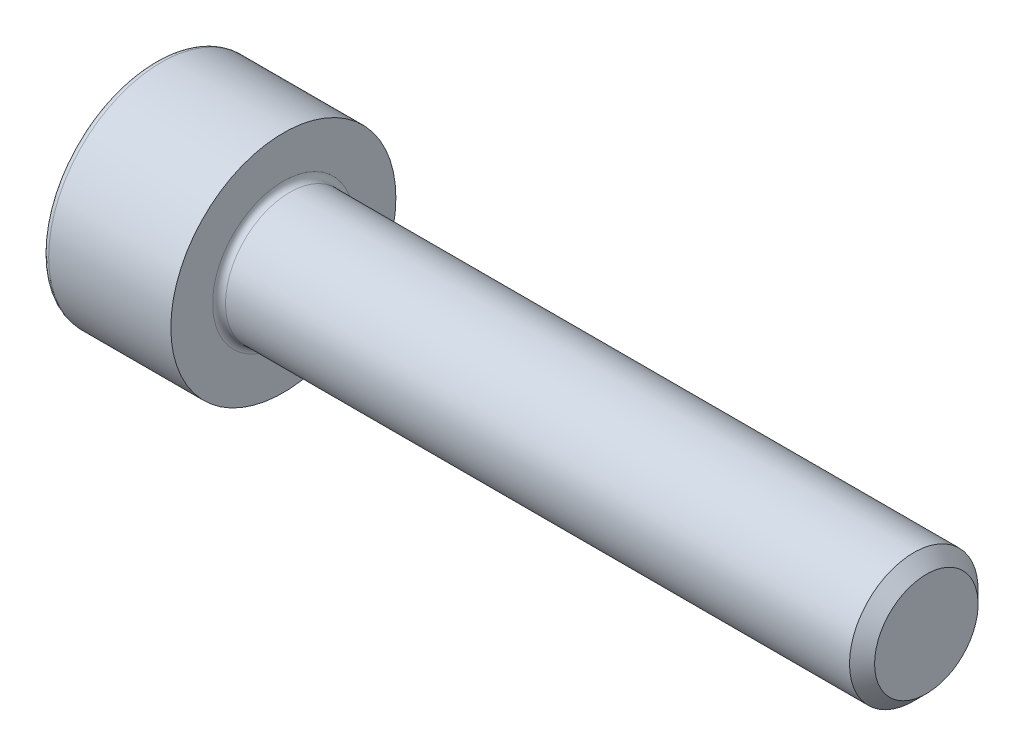
ISO-10303-21;
HEADER;
FILE_DESCRIPTION(('STEP AP214'),'2;1');
FILE_NAME('part.step','',(''),(''),'','','');
FILE_SCHEMA(('AUTOMOTIVE_DESIGN { 1 0 10303 214 1 1 1 1 }'));
ENDSEC;
DATA;
#1=APPLICATION_CONTEXT('core data for automotive mechanical design processes');
#2=APPLICATION_PROTOCOL_DEFINITION('international standard','automotive_design',2000,#1);
#3=PRODUCT_CONTEXT('',#1,'mechanical');
#4=PRODUCT('Part','Part','',(#3));
#5=PRODUCT_RELATED_PRODUCT_CATEGORY('part','',(#4));
#6=PRODUCT_DEFINITION_FORMATION('','',#4);
#7=PRODUCT_DEFINITION_CONTEXT('part definition',#1,'design');
#8=PRODUCT_DEFINITION('design','',#6,#7);
#9=PRODUCT_DEFINITION_SHAPE('','',#8);
#10=(LENGTH_UNIT() NAMED_UNIT(*) SI_UNIT(.MILLI.,.METRE.));
#11=(NAMED_UNIT(*) PLANE_ANGLE_UNIT() SI_UNIT($,.RADIAN.));
#12=(NAMED_UNIT(*) SI_UNIT($,.STERADIAN.) SOLID_ANGLE_UNIT());
#13=UNCERTAINTY_MEASURE_WITH_UNIT(LENGTH_MEASURE(1.E-05),#10,'distance_accuracy_value','');
#14=(GEOMETRIC_REPRESENTATION_CONTEXT(3) GLOBAL_UNCERTAINTY_ASSIGNED_CONTEXT((#13)) GLOBAL_UNIT_ASSIGNED_CONTEXT((#10,
#11,#12)) REPRESENTATION_CONTEXT('',''));
#15=CARTESIAN_POINT('',(0.,0.,0.));
#16=DIRECTION('',(0.,0.,1.));
#17=DIRECTION('',(1.,0.,0.));
#18=AXIS2_PLACEMENT_3D('',#15,#16,#17);
#19=CARTESIAN_POINT('',(0.,0.,0.));
#20=DIRECTION('',(-1.,0.,0.));
#21=DIRECTION('',(0.,0.,1.));
#22=AXIS2_PLACEMENT_3D('',#19,#20,#21);
#23=PLANE('',#22);
#24=DIRECTION('',(0.,-0.5,0.866025403784439));
#25=VECTOR('',#24,1.);
#26=CARTESIAN_POINT('',(0.,1.77304267668134,0.));
#27=LINE('',#26,#25);
#28=CARTESIAN_POINT('',(0.,1.77304267668134,0.));
#29=VERTEX_POINT('',#28);
#30=CARTESIAN_POINT('',(0.,0.886521338340667,1.5355));
#31=VERTEX_POINT('',#30);
#32=EDGE_CURVE('E261',#29,#31,#27,.T.);
#33=ORIENTED_EDGE('',*,*,#32,.T.);
#34=DIRECTION('',(0.,1.,0.));
#35=VECTOR('',#34,1.);
#36=CARTESIAN_POINT('',(0.,-0.886521338340676,1.5355));
#37=LINE('',#36,#35);
#38=CARTESIAN_POINT('',(0.,-0.886521338340676,1.5355));
#39=VERTEX_POINT('',#38);
#40=EDGE_CURVE('E133',#39,#31,#37,.T.);
#41=ORIENTED_EDGE('',*,*,#40,.F.);
#42=DIRECTION('',(0.,-0.500000000000001,-0.866025403784438));
#43=VECTOR('',#42,1.);
#44=CARTESIAN_POINT('',(0.,-0.886521338340676,1.5355));
#45=LINE('',#44,#43);
#46=CARTESIAN_POINT('',(0.,-1.77304267668135,0.));
#47=VERTEX_POINT('',#46);
#48=EDGE_CURVE('E264',#39,#47,#45,.T.);
#49=ORIENTED_EDGE('',*,*,#48,.T.);
#50=DIRECTION('',(0.,0.5,-0.866025403784439));
#51=VECTOR('',#50,1.);
#52=CARTESIAN_POINT('',(0.,-1.77304267668135,0.));
#53=LINE('',#52,#51);
#54=CARTESIAN_POINT('',(0.,-0.886521338340678,-1.5355));
#55=VERTEX_POINT('',#54);
#56=EDGE_CURVE('E267',#47,#55,#53,.T.);
#57=ORIENTED_EDGE('',*,*,#56,.T.);
#58=DIRECTION('',(0.,-1.,0.));
#59=VECTOR('',#58,1.);
#60=CARTESIAN_POINT('',(0.,0.886521338340663,-1.5355));
#61=LINE('',#60,#59);
#62=CARTESIAN_POINT('',(0.,0.886521338340663,-1.5355));
#63=VERTEX_POINT('',#62);
#64=EDGE_CURVE('E270',#63,#55,#61,.T.);
#65=ORIENTED_EDGE('',*,*,#64,.F.);
#66=DIRECTION('',(0.,-0.500000000000001,-0.866025403784438));
#67=VECTOR('',#66,1.);
#68=CARTESIAN_POINT('',(0.,1.77304267668134,0.));
#69=LINE('',#68,#67);
#70=EDGE_CURVE('E128',#29,#63,#69,.T.);
#71=ORIENTED_EDGE('',*,*,#70,.F.);
#72=EDGE_LOOP('',(#33,#41,#49,#57,#65,#71));
#73=FACE_BOUND('',#72,.T.);
#74=CARTESIAN_POINT('',(0.,0.,0.));
#75=DIRECTION('',(-1.,0.,0.));
#76=DIRECTION('',(0.,0.,1.));
#77=AXIS2_PLACEMENT_3D('',#74,#75,#76);
#78=CIRCLE('',#77,3.3);
#79=CARTESIAN_POINT('',(0.,0.,3.3));
#80=VERTEX_POINT('',#79);
#81=EDGE_CURVE('E45',#80,#80,#78,.T.);
#82=ORIENTED_EDGE('',*,*,#81,.T.);
#83=EDGE_LOOP('',(#82));
#84=FACE_BOUND('',#83,.T.);
#85=ADVANCED_FACE('F37',(#73,#84),#23,.T.);
#86=CARTESIAN_POINT('',(-31.75,0.,0.));
#87=DIRECTION('',(-1.,0.,0.));
#88=DIRECTION('',(0.,0.,1.));
#89=AXIS2_PLACEMENT_3D('',#86,#87,#88);
#90=CYLINDRICAL_SURFACE('',#89,3.5);
#91=CARTESIAN_POINT('',(0.199999999999999,0.,0.));
#92=DIRECTION('',(-1.,0.,0.));
#93=DIRECTION('',(0.,0.,1.));
#94=AXIS2_PLACEMENT_3D('',#91,#92,#93);
#95=CIRCLE('',#94,3.5);
#96=CARTESIAN_POINT('',(0.199999999999999,0.,3.5));
#97=VERTEX_POINT('',#96);
#98=EDGE_CURVE('E11',#97,#97,#95,.F.);
#99=ORIENTED_EDGE('',*,*,#98,.T.);
#100=EDGE_LOOP('',(#99));
#101=FACE_BOUND('',#100,.T.);
#102=CARTESIAN_POINT('',(4.,0.,0.));
#103=DIRECTION('',(-1.,0.,0.));
#104=DIRECTION('',(0.,0.,1.));
#105=AXIS2_PLACEMENT_3D('',#102,#103,#104);
#106=CIRCLE('',#105,3.5);
#107=CARTESIAN_POINT('',(4.,0.,3.5));
#108=VERTEX_POINT('',#107);
#109=EDGE_CURVE('E151',#108,#108,#106,.T.);
#110=ORIENTED_EDGE('',*,*,#109,.T.);
#111=EDGE_LOOP('',(#110));
#112=FACE_BOUND('',#111,.T.);
#113=ADVANCED_FACE('F175',(#101,#112),#90,.T.);
#114=CARTESIAN_POINT('',(4.,3.5,0.));
#115=DIRECTION('',(1.,0.,0.));
#116=DIRECTION('',(0.,0.,-1.));
#117=AXIS2_PLACEMENT_3D('',#114,#115,#116);
#118=PLANE('',#117);
#119=CARTESIAN_POINT('',(4.,0.,0.));
#120=DIRECTION('',(1.,0.,0.));
#121=DIRECTION('',(0.,0.,-1.));
#122=AXIS2_PLACEMENT_3D('',#119,#120,#121);
#123=CIRCLE('',#122,2.2);
#124=CARTESIAN_POINT('',(4.,0.,-2.2));
#125=VERTEX_POINT('',#124);
#126=EDGE_CURVE('E154',#125,#125,#123,.F.);
#127=ORIENTED_EDGE('',*,*,#126,.T.);
#128=EDGE_LOOP('',(#127));
#129=FACE_BOUND('',#128,.T.);
#130=ORIENTED_EDGE('',*,*,#109,.F.);
#131=EDGE_LOOP('',(#130));
#132=FACE_BOUND('',#131,.T.);
#133=ADVANCED_FACE('F181',(#129,#132),#118,.T.);
#134=CARTESIAN_POINT('',(-31.75,0.,0.));
#135=DIRECTION('',(-1.,0.,0.));
#136=DIRECTION('',(0.,0.,1.));
#137=AXIS2_PLACEMENT_3D('',#134,#135,#136);
#138=CYLINDRICAL_SURFACE('',#137,2.);
#139=CARTESIAN_POINT('',(4.2,0.,0.));
#140=DIRECTION('',(1.,0.,0.));
#141=DIRECTION('',(0.,0.,-1.));
#142=AXIS2_PLACEMENT_3D('',#139,#140,#141);
#143=CIRCLE('',#142,2.);
#144=CARTESIAN_POINT('',(4.2,0.,-2.));
#145=VERTEX_POINT('',#144);
#146=EDGE_CURVE('E157',#145,#145,#143,.T.);
#147=ORIENTED_EDGE('',*,*,#146,.T.);
#148=EDGE_LOOP('',(#147));
#149=FACE_BOUND('',#148,.T.);
#150=CARTESIAN_POINT('',(23.61,0.,0.));
#151=DIRECTION('',(-1.,0.,0.));
#152=DIRECTION('',(0.,0.,1.));
#153=AXIS2_PLACEMENT_3D('',#150,#151,#152);
#154=CIRCLE('',#153,2.);
#155=CARTESIAN_POINT('',(23.61,0.,2.));
#156=VERTEX_POINT('',#155);
#157=EDGE_CURVE('E148',#156,#156,#154,.T.);
#158=ORIENTED_EDGE('',*,*,#157,.T.);
#159=EDGE_LOOP('',(#158));
#160=FACE_BOUND('',#159,.T.);
#161=ADVANCED_FACE('F187',(#149,#160),#138,.T.);
#162=CARTESIAN_POINT('',(24.,0.,0.));
#163=DIRECTION('',(-1.,0.,0.));
#164=DIRECTION('',(0.,0.,1.));
#165=AXIS2_PLACEMENT_3D('',#162,#163,#164);
#166=CONICAL_SURFACE('',#165,1.61,0.785398163397456);
#167=ORIENTED_EDGE('',*,*,#157,.F.);
#168=EDGE_LOOP('',(#167));
#169=FACE_BOUND('',#168,.T.);
#170=CARTESIAN_POINT('',(24.,0.,0.));
#171=DIRECTION('',(-1.,0.,0.));
#172=DIRECTION('',(0.,0.,1.));
#173=AXIS2_PLACEMENT_3D('',#170,#171,#172);
#174=CIRCLE('',#173,1.61);
#175=CARTESIAN_POINT('',(24.,0.,1.61));
#176=VERTEX_POINT('',#175);
#177=EDGE_CURVE('E144',#176,#176,#174,.T.);
#178=ORIENTED_EDGE('',*,*,#177,.T.);
#179=EDGE_LOOP('',(#178));
#180=FACE_BOUND('',#179,.T.);
#181=ADVANCED_FACE('F191',(#169,#180),#166,.T.);
#182=CARTESIAN_POINT('',(24.,1.61,0.));
#183=DIRECTION('',(1.,0.,0.));
#184=DIRECTION('',(0.,0.,-1.));
#185=AXIS2_PLACEMENT_3D('',#182,#183,#184);
#186=PLANE('',#185);
#187=ORIENTED_EDGE('',*,*,#177,.F.);
#188=EDGE_LOOP('',(#187));
#189=FACE_BOUND('',#188,.T.);
#190=ADVANCED_FACE('F171',(#189),#186,.T.);
#191=CARTESIAN_POINT('',(4.2,0.,0.));
#192=DIRECTION('',(1.,0.,0.));
#193=DIRECTION('',(0.,0.,-1.));
#194=AXIS2_PLACEMENT_3D('',#191,#192,#193);
#195=TOROIDAL_SURFACE('',#194,2.2,0.2);
#196=ORIENTED_EDGE('',*,*,#146,.F.);
#197=EDGE_LOOP('',(#196));
#198=FACE_BOUND('',#197,.T.);
#199=ORIENTED_EDGE('',*,*,#126,.F.);
#200=EDGE_LOOP('',(#199));
#201=FACE_BOUND('',#200,.T.);
#202=ADVANCED_FACE('F164',(#198,#201),#195,.F.);
#203=CARTESIAN_POINT('',(0.199999999999999,0.,0.));
#204=DIRECTION('',(-1.,0.,0.));
#205=DIRECTION('',(0.,0.,1.));
#206=AXIS2_PLACEMENT_3D('',#203,#204,#205);
#207=TOROIDAL_SURFACE('',#206,3.3,0.2);
#208=ORIENTED_EDGE('',*,*,#98,.F.);
#209=EDGE_LOOP('',(#208));
#210=FACE_BOUND('',#209,.T.);
#211=ORIENTED_EDGE('',*,*,#81,.F.);
#212=EDGE_LOOP('',(#211));
#213=FACE_BOUND('',#212,.T.);
#214=ADVANCED_FACE('F39',(#210,#213),#207,.T.);
#215=CARTESIAN_POINT('',(2.,1.77304267668134,0.));
#216=DIRECTION('',(0.,-0.866025403784439,-0.499999999999999));
#217=DIRECTION('',(0.,0.5,-0.866025403784439));
#218=AXIS2_PLACEMENT_3D('',#215,#216,#217);
#219=PLANE('',#218);
#220=ORIENTED_EDGE('',*,*,#32,.F.);
#221=DIRECTION('',(-1.,0.,0.));
#222=VECTOR('',#221,1.);
#223=CARTESIAN_POINT('',(2.,1.77304267668134,0.));
#224=LINE('',#223,#222);
#225=CARTESIAN_POINT('',(2.,1.77304267668134,0.));
#226=VERTEX_POINT('',#225);
#227=EDGE_CURVE('E251',#226,#29,#224,.T.);
#228=ORIENTED_EDGE('',*,*,#227,.F.);
#229=DIRECTION('',(0.,-0.5,0.866025403784439));
#230=VECTOR('',#229,1.);
#231=CARTESIAN_POINT('',(2.,1.77304267668134,0.));
#232=LINE('',#231,#230);
#233=CARTESIAN_POINT('',(2.,1.329782007511,0.767749999999998));
#234=VERTEX_POINT('',#233);
#235=EDGE_CURVE('E120',#226,#234,#232,.T.);
#236=ORIENTED_EDGE('',*,*,#235,.T.);
#237=CARTESIAN_POINT('',(2.,0.886521338340667,1.5355));
#238=VERTEX_POINT('',#237);
#239=EDGE_CURVE('E111',#234,#238,#232,.T.);
#240=ORIENTED_EDGE('',*,*,#239,.T.);
#241=DIRECTION('',(-1.,0.,0.));
#242=VECTOR('',#241,1.);
#243=CARTESIAN_POINT('',(2.,0.886521338340667,1.5355));
#244=LINE('',#243,#242);
#245=EDGE_CURVE('E125',#238,#31,#244,.T.);
#246=ORIENTED_EDGE('',*,*,#245,.T.);
#247=EDGE_LOOP('',(#220,#228,#236,#240,#246));
#248=FACE_BOUND('',#247,.T.);
#249=ADVANCED_FACE('F124',(#248),#219,.T.);
#250=CARTESIAN_POINT('',(2.,-0.886521338340676,1.5355));
#251=DIRECTION('',(0.,0.,1.));
#252=DIRECTION('',(0.,-1.,0.));
#253=AXIS2_PLACEMENT_3D('',#250,#251,#252);
#254=PLANE('',#253);
#255=ORIENTED_EDGE('',*,*,#40,.T.);
#256=ORIENTED_EDGE('',*,*,#245,.F.);
#257=DIRECTION('',(0.,1.,0.));
#258=VECTOR('',#257,1.);
#259=CARTESIAN_POINT('',(2.,-0.886521338340676,1.5355));
#260=LINE('',#259,#258);
#261=CARTESIAN_POINT('',(2.,0.,1.5355));
#262=VERTEX_POINT('',#261);
#263=EDGE_CURVE('E108',#262,#238,#260,.T.);
#264=ORIENTED_EDGE('',*,*,#263,.F.);
#265=CARTESIAN_POINT('',(2.,-0.886521338340676,1.5355));
#266=VERTEX_POINT('',#265);
#267=EDGE_CURVE('E119',#266,#262,#260,.T.);
#268=ORIENTED_EDGE('',*,*,#267,.F.);
#269=DIRECTION('',(-1.,0.,0.));
#270=VECTOR('',#269,1.);
#271=CARTESIAN_POINT('',(2.,-0.886521338340676,1.5355));
#272=LINE('',#271,#270);
#273=EDGE_CURVE('E135',#266,#39,#272,.T.);
#274=ORIENTED_EDGE('',*,*,#273,.T.);
#275=EDGE_LOOP('',(#255,#256,#264,#268,#274));
#276=FACE_BOUND('',#275,.T.);
#277=ADVANCED_FACE('F130',(#276),#254,.F.);
#278=CARTESIAN_POINT('',(2.,-0.886521338340676,1.5355));
#279=DIRECTION('',(0.,0.866025403784438,-0.500000000000001));
#280=DIRECTION('',(0.,0.500000000000001,0.866025403784438));
#281=AXIS2_PLACEMENT_3D('',#278,#279,#280);
#282=PLANE('',#281);
#283=ORIENTED_EDGE('',*,*,#48,.F.);
#284=ORIENTED_EDGE('',*,*,#273,.F.);
#285=DIRECTION('',(0.,-0.500000000000001,-0.866025403784438));
#286=VECTOR('',#285,1.);
#287=CARTESIAN_POINT('',(2.,-0.886521338340676,1.5355));
#288=LINE('',#287,#286);
#289=CARTESIAN_POINT('',(2.,-1.32978200751101,0.767750000000005));
#290=VERTEX_POINT('',#289);
#291=EDGE_CURVE('E290',#266,#290,#288,.T.);
#292=ORIENTED_EDGE('',*,*,#291,.T.);
#293=CARTESIAN_POINT('',(2.,-1.77304267668135,0.));
#294=VERTEX_POINT('',#293);
#295=EDGE_CURVE('E279',#290,#294,#288,.T.);
#296=ORIENTED_EDGE('',*,*,#295,.T.);
#297=DIRECTION('',(-1.,0.,0.));
#298=VECTOR('',#297,1.);
#299=CARTESIAN_POINT('',(2.,-1.77304267668135,0.));
#300=LINE('',#299,#298);
#301=EDGE_CURVE('E140',#294,#47,#300,.T.);
#302=ORIENTED_EDGE('',*,*,#301,.T.);
#303=EDGE_LOOP('',(#283,#284,#292,#296,#302));
#304=FACE_BOUND('',#303,.T.);
#305=ADVANCED_FACE('F205',(#304),#282,.T.);
#306=CARTESIAN_POINT('',(2.,-1.77304267668135,0.));
#307=DIRECTION('',(0.,0.866025403784439,0.5));
#308=DIRECTION('',(0.,-0.5,0.866025403784439));
#309=AXIS2_PLACEMENT_3D('',#306,#307,#308);
#310=PLANE('',#309);
#311=ORIENTED_EDGE('',*,*,#56,.F.);
#312=ORIENTED_EDGE('',*,*,#301,.F.);
#313=DIRECTION('',(0.,0.5,-0.866025403784439));
#314=VECTOR('',#313,1.);
#315=CARTESIAN_POINT('',(2.,-1.77304267668135,0.));
#316=LINE('',#315,#314);
#317=CARTESIAN_POINT('',(2.,-1.32978200751101,-0.767750000000002));
#318=VERTEX_POINT('',#317);
#319=EDGE_CURVE('E257',#294,#318,#316,.T.);
#320=ORIENTED_EDGE('',*,*,#319,.T.);
#321=CARTESIAN_POINT('',(2.,-0.886521338340678,-1.5355));
#322=VERTEX_POINT('',#321);
#323=EDGE_CURVE('E289',#318,#322,#316,.T.);
#324=ORIENTED_EDGE('',*,*,#323,.T.);
#325=DIRECTION('',(-1.,0.,0.));
#326=VECTOR('',#325,1.);
#327=CARTESIAN_POINT('',(2.,-0.886521338340678,-1.5355));
#328=LINE('',#327,#326);
#329=EDGE_CURVE('E250',#322,#55,#328,.T.);
#330=ORIENTED_EDGE('',*,*,#329,.T.);
#331=EDGE_LOOP('',(#311,#312,#320,#324,#330));
#332=FACE_BOUND('',#331,.T.);
#333=ADVANCED_FACE('F208',(#332),#310,.T.);
#334=CARTESIAN_POINT('',(2.,0.886521338340663,-1.5355));
#335=DIRECTION('',(0.,0.,-1.));
#336=DIRECTION('',(0.,1.,0.));
#337=AXIS2_PLACEMENT_3D('',#334,#335,#336);
#338=PLANE('',#337);
#339=ORIENTED_EDGE('',*,*,#64,.T.);
#340=ORIENTED_EDGE('',*,*,#329,.F.);
#341=DIRECTION('',(0.,-1.,0.));
#342=VECTOR('',#341,1.);
#343=CARTESIAN_POINT('',(2.,0.886521338340663,-1.5355));
#344=LINE('',#343,#342);
#345=CARTESIAN_POINT('',(2.,0.,-1.5355));
#346=VERTEX_POINT('',#345);
#347=EDGE_CURVE('E254',#346,#322,#344,.T.);
#348=ORIENTED_EDGE('',*,*,#347,.F.);
#349=CARTESIAN_POINT('',(2.,0.886521338340663,-1.5355));
#350=VERTEX_POINT('',#349);
#351=EDGE_CURVE('E52',#350,#346,#344,.T.);
#352=ORIENTED_EDGE('',*,*,#351,.F.);
#353=DIRECTION('',(-1.,0.,0.));
#354=VECTOR('',#353,1.);
#355=CARTESIAN_POINT('',(2.,0.886521338340663,-1.5355));
#356=LINE('',#355,#354);
#357=EDGE_CURVE('E247',#350,#63,#356,.T.);
#358=ORIENTED_EDGE('',*,*,#357,.T.);
#359=EDGE_LOOP('',(#339,#340,#348,#352,#358));
#360=FACE_BOUND('',#359,.T.);
#361=ADVANCED_FACE('F212',(#360),#338,.F.);
#362=CARTESIAN_POINT('',(2.,1.77304267668134,0.));
#363=DIRECTION('',(0.,0.866025403784438,-0.500000000000001));
#364=DIRECTION('',(0.,0.500000000000001,0.866025403784438));
#365=AXIS2_PLACEMENT_3D('',#362,#363,#364);
#366=PLANE('',#365);
#367=ORIENTED_EDGE('',*,*,#70,.T.);
#368=ORIENTED_EDGE('',*,*,#357,.F.);
#369=DIRECTION('',(0.,-0.500000000000001,-0.866025403784438));
#370=VECTOR('',#369,1.);
#371=CARTESIAN_POINT('',(2.,1.77304267668134,0.));
#372=LINE('',#371,#370);
#373=CARTESIAN_POINT('',(2.,1.329782007511,-0.767749999999999));
#374=VERTEX_POINT('',#373);
#375=EDGE_CURVE('E237',#374,#350,#372,.T.);
#376=ORIENTED_EDGE('',*,*,#375,.F.);
#377=EDGE_CURVE('E243',#226,#374,#372,.T.);
#378=ORIENTED_EDGE('',*,*,#377,.F.);
#379=ORIENTED_EDGE('',*,*,#227,.T.);
#380=EDGE_LOOP('',(#367,#368,#376,#378,#379));
#381=FACE_BOUND('',#380,.T.);
#382=ADVANCED_FACE('F216',(#381),#366,.F.);
#383=CARTESIAN_POINT('',(2.,1.77304267668134,0.));
#384=DIRECTION('',(1.,0.,0.));
#385=DIRECTION('',(0.,0.,-1.));
#386=AXIS2_PLACEMENT_3D('',#383,#384,#385);
#387=PLANE('',#386);
#388=ORIENTED_EDGE('',*,*,#347,.T.);
#389=ORIENTED_EDGE('',*,*,#323,.F.);
#390=CARTESIAN_POINT('',(2.,0.,0.));
#391=DIRECTION('',(-1.,0.,0.));
#392=DIRECTION('',(0.,0.,1.));
#393=AXIS2_PLACEMENT_3D('',#390,#391,#392);
#394=CIRCLE('',#393,1.5355);
#395=EDGE_CURVE('E285',#346,#318,#394,.T.);
#396=ORIENTED_EDGE('',*,*,#395,.F.);
#397=EDGE_LOOP('',(#388,#389,#396));
#398=FACE_BOUND('',#397,.T.);
#399=ADVANCED_FACE('F220',(#398),#387,.F.);
#400=ORIENTED_EDGE('',*,*,#319,.F.);
#401=ORIENTED_EDGE('',*,*,#295,.F.);
#402=EDGE_CURVE('E138',#318,#290,#394,.T.);
#403=ORIENTED_EDGE('',*,*,#402,.F.);
#404=EDGE_LOOP('',(#400,#401,#403));
#405=FACE_BOUND('',#404,.T.);
#406=ADVANCED_FACE('F223',(#405),#387,.F.);
#407=ORIENTED_EDGE('',*,*,#291,.F.);
#408=ORIENTED_EDGE('',*,*,#267,.T.);
#409=EDGE_CURVE('E134',#290,#262,#394,.T.);
#410=ORIENTED_EDGE('',*,*,#409,.F.);
#411=EDGE_LOOP('',(#407,#408,#410));
#412=FACE_BOUND('',#411,.T.);
#413=ADVANCED_FACE('F228',(#412),#387,.F.);
#414=ORIENTED_EDGE('',*,*,#263,.T.);
#415=ORIENTED_EDGE('',*,*,#239,.F.);
#416=EDGE_CURVE('E114',#262,#234,#394,.T.);
#417=ORIENTED_EDGE('',*,*,#416,.F.);
#418=EDGE_LOOP('',(#414,#415,#417));
#419=FACE_BOUND('',#418,.T.);
#420=ADVANCED_FACE('F110',(#419),#387,.F.);
#421=ORIENTED_EDGE('',*,*,#235,.F.);
#422=ORIENTED_EDGE('',*,*,#377,.T.);
#423=EDGE_CURVE('E145',#234,#374,#394,.T.);
#424=ORIENTED_EDGE('',*,*,#423,.F.);
#425=EDGE_LOOP('',(#421,#422,#424));
#426=FACE_BOUND('',#425,.T.);
#427=ADVANCED_FACE('F231',(#426),#387,.F.);
#428=ORIENTED_EDGE('',*,*,#375,.T.);
#429=ORIENTED_EDGE('',*,*,#351,.T.);
#430=EDGE_CURVE('E240',#374,#346,#394,.T.);
#431=ORIENTED_EDGE('',*,*,#430,.F.);
#432=EDGE_LOOP('',(#428,#429,#431));
#433=FACE_BOUND('',#432,.T.);
#434=ADVANCED_FACE('F201',(#433),#387,.F.);
#435=CARTESIAN_POINT('',(2.,0.,0.));
#436=DIRECTION('',(-1.,0.,0.));
#437=DIRECTION('',(0.,0.,1.));
#438=AXIS2_PLACEMENT_3D('',#435,#436,#437);
#439=CONICAL_SURFACE('',#438,1.5355,1.04719755119659);
#440=CARTESIAN_POINT('',(2.88652133834068,0.,0.));
#441=VERTEX_POINT('',#440);
#442=VERTEX_LOOP('',#441);
#443=FACE_BOUND('',#442,.T.);
#444=ORIENTED_EDGE('',*,*,#416,.T.);
#445=ORIENTED_EDGE('',*,*,#423,.T.);
#446=ORIENTED_EDGE('',*,*,#430,.T.);
#447=ORIENTED_EDGE('',*,*,#395,.T.);
#448=ORIENTED_EDGE('',*,*,#402,.T.);
#449=ORIENTED_EDGE('',*,*,#409,.T.);
#450=EDGE_LOOP('',(#444,#445,#446,#447,#448,#449));
#451=FACE_BOUND('',#450,.T.);
#452=ADVANCED_FACE('F199',(#443,#451),#439,.F.);
#453=CLOSED_SHELL('',(#85,#113,#133,#161,#181,#190,#202,#214,#249,#277,#305,#333,#361,#382,#399,
#406,#413,#420,#427,#434,#452));
#454=MANIFOLD_SOLID_BREP('B2',#453);
#455=ADVANCED_BREP_SHAPE_REPRESENTATION('',(#18,#454),#14);
#456=SHAPE_DEFINITION_REPRESENTATION(#9,#455);
ENDSEC;
END-ISO-10303-21;
